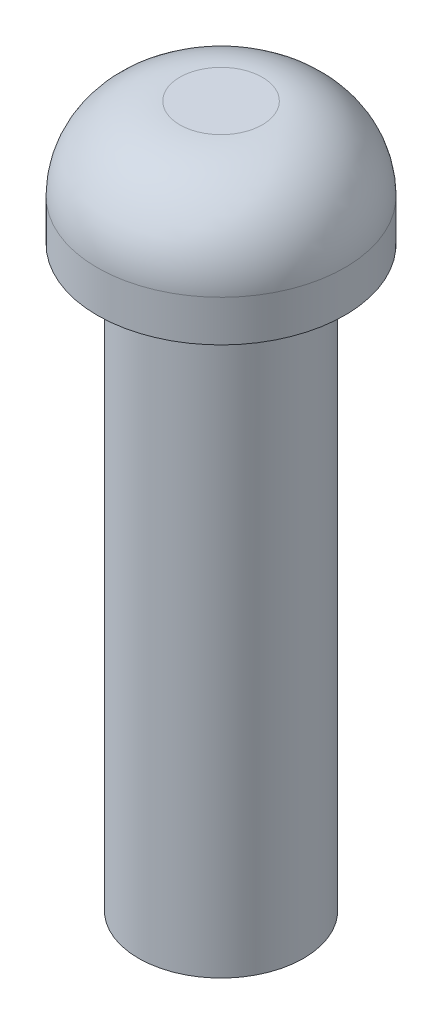
ISO-10303-21;
HEADER;
FILE_DESCRIPTION(('STEP AP214'),'2;1');
FILE_NAME('part.step','',(''),(''),'','','');
FILE_SCHEMA(('AUTOMOTIVE_DESIGN { 1 0 10303 214 1 1 1 1 }'));
ENDSEC;
DATA;
#1=APPLICATION_CONTEXT('core data for automotive mechanical design processes');
#2=APPLICATION_PROTOCOL_DEFINITION('international standard','automotive_design',2000,#1);
#3=PRODUCT_CONTEXT('',#1,'mechanical');
#4=PRODUCT('Part','Part','',(#3));
#5=PRODUCT_RELATED_PRODUCT_CATEGORY('part','',(#4));
#6=PRODUCT_DEFINITION_FORMATION('','',#4);
#7=PRODUCT_DEFINITION_CONTEXT('part definition',#1,'design');
#8=PRODUCT_DEFINITION('design','',#6,#7);
#9=PRODUCT_DEFINITION_SHAPE('','',#8);
#10=(LENGTH_UNIT() NAMED_UNIT(*) SI_UNIT(.MILLI.,.METRE.));
#11=(NAMED_UNIT(*) PLANE_ANGLE_UNIT() SI_UNIT($,.RADIAN.));
#12=(NAMED_UNIT(*) SI_UNIT($,.STERADIAN.) SOLID_ANGLE_UNIT());
#13=UNCERTAINTY_MEASURE_WITH_UNIT(LENGTH_MEASURE(1.E-05),#10,'distance_accuracy_value','');
#14=(GEOMETRIC_REPRESENTATION_CONTEXT(3) GLOBAL_UNCERTAINTY_ASSIGNED_CONTEXT((#13)) GLOBAL_UNIT_ASSIGNED_CONTEXT((#10,
#11,#12)) REPRESENTATION_CONTEXT('',''));
#15=CARTESIAN_POINT('',(0.,0.,0.));
#16=DIRECTION('',(0.,0.,1.));
#17=DIRECTION('',(1.,0.,0.));
#18=AXIS2_PLACEMENT_3D('',#15,#16,#17);
#19=CARTESIAN_POINT('',(0.,0.,0.));
#20=DIRECTION('',(0.,1.,0.));
#21=DIRECTION('',(0.,0.,1.));
#22=AXIS2_PLACEMENT_3D('',#19,#20,#21);
#23=PLANE('',#22);
#24=CARTESIAN_POINT('',(0.,0.,0.));
#25=DIRECTION('',(0.,1.,0.));
#26=DIRECTION('',(0.,0.,1.));
#27=AXIS2_PLACEMENT_3D('',#24,#25,#26);
#28=CIRCLE('',#27,15.);
#29=CARTESIAN_POINT('',(0.,0.,15.));
#30=VERTEX_POINT('',#29);
#31=EDGE_CURVE('E46',#30,#30,#28,.T.);
#32=ORIENTED_EDGE('',*,*,#31,.F.);
#33=EDGE_LOOP('',(#32));
#34=FACE_BOUND('',#33,.T.);
#35=CARTESIAN_POINT('',(0.,0.,0.));
#36=DIRECTION('',(0.,1.,0.));
#37=DIRECTION('',(0.,0.,1.));
#38=AXIS2_PLACEMENT_3D('',#35,#36,#37);
#39=CIRCLE('',#38,10.);
#40=CARTESIAN_POINT('',(0.,0.,10.));
#41=VERTEX_POINT('',#40);
#42=EDGE_CURVE('E10',#41,#41,#39,.F.);
#43=ORIENTED_EDGE('',*,*,#42,.F.);
#44=EDGE_LOOP('',(#43));
#45=FACE_BOUND('',#44,.T.);
#46=ADVANCED_FACE('F31',(#34,#45),#23,.F.);
#47=CARTESIAN_POINT('',(0.,15.,0.));
#48=DIRECTION('',(0.,-1.,0.));
#49=DIRECTION('',(0.,0.,-1.));
#50=AXIS2_PLACEMENT_3D('',#47,#48,#49);
#51=CYLINDRICAL_SURFACE('',#50,15.);
#52=CARTESIAN_POINT('',(0.,5.,0.));
#53=DIRECTION('',(0.,1.,0.));
#54=DIRECTION('',(0.,0.,1.));
#55=AXIS2_PLACEMENT_3D('',#52,#53,#54);
#56=CIRCLE('',#55,15.);
#57=CARTESIAN_POINT('',(0.,5.,15.));
#58=VERTEX_POINT('',#57);
#59=EDGE_CURVE('E38',#58,#58,#56,.F.);
#60=ORIENTED_EDGE('',*,*,#59,.T.);
#61=EDGE_LOOP('',(#60));
#62=FACE_BOUND('',#61,.T.);
#63=ORIENTED_EDGE('',*,*,#31,.T.);
#64=EDGE_LOOP('',(#63));
#65=FACE_BOUND('',#64,.T.);
#66=ADVANCED_FACE('F69',(#62,#65),#51,.T.);
#67=CARTESIAN_POINT('',(0.,15.,0.));
#68=DIRECTION('',(0.,1.,0.));
#69=DIRECTION('',(0.,0.,1.));
#70=AXIS2_PLACEMENT_3D('',#67,#68,#69);
#71=PLANE('',#70);
#72=CARTESIAN_POINT('',(0.,15.,0.));
#73=DIRECTION('',(0.,1.,0.));
#74=DIRECTION('',(0.,0.,1.));
#75=AXIS2_PLACEMENT_3D('',#72,#73,#74);
#76=CIRCLE('',#75,5.);
#77=CARTESIAN_POINT('',(0.,15.,5.));
#78=VERTEX_POINT('',#77);
#79=EDGE_CURVE('E42',#78,#78,#76,.T.);
#80=ORIENTED_EDGE('',*,*,#79,.T.);
#81=EDGE_LOOP('',(#80));
#82=FACE_BOUND('',#81,.T.);
#83=ADVANCED_FACE('F65',(#82),#71,.T.);
#84=CARTESIAN_POINT('',(0.,5.,0.));
#85=DIRECTION('',(0.,1.,0.));
#86=DIRECTION('',(0.,0.,1.));
#87=AXIS2_PLACEMENT_3D('',#84,#85,#86);
#88=DEGENERATE_TOROIDAL_SURFACE('',#87,5.,10.,.T.);
#89=ORIENTED_EDGE('',*,*,#59,.F.);
#90=EDGE_LOOP('',(#89));
#91=FACE_BOUND('',#90,.T.);
#92=ORIENTED_EDGE('',*,*,#79,.F.);
#93=EDGE_LOOP('',(#92));
#94=FACE_BOUND('',#93,.T.);
#95=ADVANCED_FACE('F33',(#91,#94),#88,.T.);
#96=CARTESIAN_POINT('',(0.,-70.,0.));
#97=DIRECTION('',(0.,1.,0.));
#98=DIRECTION('',(0.,0.,1.));
#99=AXIS2_PLACEMENT_3D('',#96,#97,#98);
#100=CYLINDRICAL_SURFACE('',#99,10.);
#101=CARTESIAN_POINT('',(0.,-70.,0.));
#102=DIRECTION('',(0.,-1.,0.));
#103=DIRECTION('',(0.,0.,-1.));
#104=AXIS2_PLACEMENT_3D('',#101,#102,#103);
#105=CIRCLE('',#104,10.);
#106=CARTESIAN_POINT('',(0.,-70.,-10.));
#107=VERTEX_POINT('',#106);
#108=EDGE_CURVE('E51',#107,#107,#105,.T.);
#109=ORIENTED_EDGE('',*,*,#108,.F.);
#110=EDGE_LOOP('',(#109));
#111=FACE_BOUND('',#110,.T.);
#112=ORIENTED_EDGE('',*,*,#42,.T.);
#113=EDGE_LOOP('',(#112));
#114=FACE_BOUND('',#113,.T.);
#115=ADVANCED_FACE('F57',(#111,#114),#100,.T.);
#116=CARTESIAN_POINT('',(0.,-70.,0.));
#117=DIRECTION('',(0.,-1.,0.));
#118=DIRECTION('',(0.,0.,-1.));
#119=AXIS2_PLACEMENT_3D('',#116,#117,#118);
#120=PLANE('',#119);
#121=ORIENTED_EDGE('',*,*,#108,.T.);
#122=EDGE_LOOP('',(#121));
#123=FACE_BOUND('',#122,.T.);
#124=ADVANCED_FACE('F55',(#123),#120,.T.);
#125=CLOSED_SHELL('',(#46,#66,#83,#95,#115,#124));
#126=MANIFOLD_SOLID_BREP('B2',#125);
#127=ADVANCED_BREP_SHAPE_REPRESENTATION('',(#18,#126),#14);
#128=SHAPE_DEFINITION_REPRESENTATION(#9,#127);
ENDSEC;
END-ISO-10303-21;
